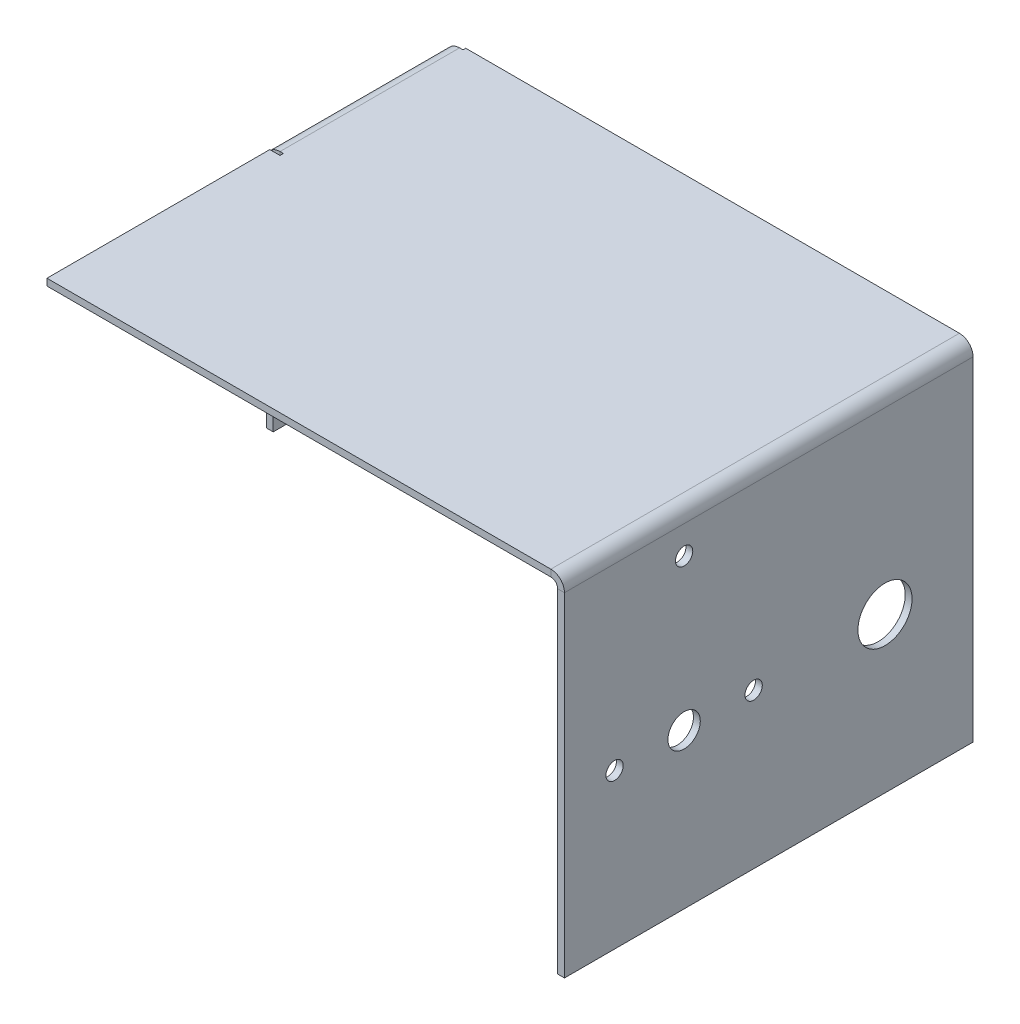
ISO-10303-21;
HEADER;
FILE_DESCRIPTION(('STEP AP214'),'2;1');
FILE_NAME('part.step','',(''),(''),'','','');
FILE_SCHEMA(('AUTOMOTIVE_DESIGN { 1 0 10303 214 1 1 1 1 }'));
ENDSEC;
DATA;
#1=APPLICATION_CONTEXT('core data for automotive mechanical design processes');
#2=APPLICATION_PROTOCOL_DEFINITION('international standard','automotive_design',2000,#1);
#3=PRODUCT_CONTEXT('',#1,'mechanical');
#4=PRODUCT('Part','Part','',(#3));
#5=PRODUCT_RELATED_PRODUCT_CATEGORY('part','',(#4));
#6=PRODUCT_DEFINITION_FORMATION('','',#4);
#7=PRODUCT_DEFINITION_CONTEXT('part definition',#1,'design');
#8=PRODUCT_DEFINITION('design','',#6,#7);
#9=PRODUCT_DEFINITION_SHAPE('','',#8);
#10=(LENGTH_UNIT() NAMED_UNIT(*) SI_UNIT(.MILLI.,.METRE.));
#11=(NAMED_UNIT(*) PLANE_ANGLE_UNIT() SI_UNIT($,.RADIAN.));
#12=(NAMED_UNIT(*) SI_UNIT($,.STERADIAN.) SOLID_ANGLE_UNIT());
#13=UNCERTAINTY_MEASURE_WITH_UNIT(LENGTH_MEASURE(1.E-05),#10,'distance_accuracy_value','');
#14=(GEOMETRIC_REPRESENTATION_CONTEXT(3) GLOBAL_UNCERTAINTY_ASSIGNED_CONTEXT((#13)) GLOBAL_UNIT_ASSIGNED_CONTEXT((#10,
#11,#12)) REPRESENTATION_CONTEXT('',''));
#15=CARTESIAN_POINT('',(0.,0.,0.));
#16=DIRECTION('',(0.,0.,1.));
#17=DIRECTION('',(1.,0.,0.));
#18=AXIS2_PLACEMENT_3D('',#15,#16,#17);
#19=CARTESIAN_POINT('',(0.,-1.,0.));
#20=DIRECTION('',(0.,1.,0.));
#21=DIRECTION('',(0.,0.,1.));
#22=AXIS2_PLACEMENT_3D('',#19,#20,#21);
#23=PLANE('',#22);
#24=DIRECTION('',(0.,0.,1.));
#25=VECTOR('',#24,1.);
#26=CARTESIAN_POINT('',(-36.,-0.99999999999999,-30.094208410316));
#27=LINE('',#26,#25);
#28=CARTESIAN_POINT('',(-36.,-0.99999999999999,-30.));
#29=VERTEX_POINT('',#28);
#30=CARTESIAN_POINT('',(-36.,-0.99999999999999,-29.594208410316));
#31=VERTEX_POINT('',#30);
#32=EDGE_CURVE('E226',#29,#31,#27,.T.);
#33=ORIENTED_EDGE('',*,*,#32,.F.);
#34=DIRECTION('',(-1.,0.,0.));
#35=VECTOR('',#34,1.);
#36=CARTESIAN_POINT('',(37.5,-1.,-30.));
#37=LINE('',#36,#35);
#38=CARTESIAN_POINT('',(36.5,-0.999999999999997,-30.));
#39=VERTEX_POINT('',#38);
#40=EDGE_CURVE('E311',#39,#29,#37,.T.);
#41=ORIENTED_EDGE('',*,*,#40,.F.);
#42=DIRECTION('',(0.,0.,1.));
#43=VECTOR('',#42,1.);
#44=CARTESIAN_POINT('',(36.5,-0.999999999999997,30.));
#45=LINE('',#44,#43);
#46=CARTESIAN_POINT('',(36.5,-0.999999999999997,30.));
#47=VERTEX_POINT('',#46);
#48=EDGE_CURVE('E296',#47,#39,#45,.F.);
#49=ORIENTED_EDGE('',*,*,#48,.F.);
#50=DIRECTION('',(1.,0.,0.));
#51=VECTOR('',#50,1.);
#52=CARTESIAN_POINT('',(37.5,-1.,30.));
#53=LINE('',#52,#51);
#54=CARTESIAN_POINT('',(-37.5,-1.,30.));
#55=VERTEX_POINT('',#54);
#56=EDGE_CURVE('E307',#55,#47,#53,.T.);
#57=ORIENTED_EDGE('',*,*,#56,.F.);
#58=DIRECTION('',(0.,0.,1.));
#59=VECTOR('',#58,1.);
#60=CARTESIAN_POINT('',(-37.5,-1.,30.));
#61=LINE('',#60,#59);
#62=CARTESIAN_POINT('',(-37.5,-0.999999999999995,-2.72486828633828));
#63=VERTEX_POINT('',#62);
#64=EDGE_CURVE('E305',#63,#55,#61,.T.);
#65=ORIENTED_EDGE('',*,*,#64,.F.);
#66=DIRECTION('',(-1.,0.,0.));
#67=VECTOR('',#66,1.);
#68=CARTESIAN_POINT('',(-36.,-0.99999999999999,-2.72486828633828));
#69=LINE('',#68,#67);
#70=CARTESIAN_POINT('',(-36.,-0.99999999999999,-2.72486828633828));
#71=VERTEX_POINT('',#70);
#72=EDGE_CURVE('E239',#71,#63,#69,.T.);
#73=ORIENTED_EDGE('',*,*,#72,.F.);
#74=DIRECTION('',(0.,0.,1.));
#75=VECTOR('',#74,1.);
#76=CARTESIAN_POINT('',(-36.,-0.99999999999999,-3.22486828633828));
#77=LINE('',#76,#75);
#78=CARTESIAN_POINT('',(-36.,-0.99999999999999,-3.22486828633828));
#79=VERTEX_POINT('',#78);
#80=EDGE_CURVE('E235',#79,#71,#77,.T.);
#81=ORIENTED_EDGE('',*,*,#80,.F.);
#82=DIRECTION('',(1.,0.,0.));
#83=VECTOR('',#82,1.);
#84=CARTESIAN_POINT('',(-36.5,-0.99999999999999,-3.22486828633828));
#85=LINE('',#84,#83);
#86=CARTESIAN_POINT('',(-36.5,-0.99999999999999,-3.22486828633828));
#87=VERTEX_POINT('',#86);
#88=EDGE_CURVE('E232',#87,#79,#85,.T.);
#89=ORIENTED_EDGE('',*,*,#88,.F.);
#90=DIRECTION('',(0.,0.,-1.));
#91=VECTOR('',#90,1.);
#92=CARTESIAN_POINT('',(-36.5,-0.99999999999999,-29.594208410316));
#93=LINE('',#92,#91);
#94=CARTESIAN_POINT('',(-36.5,-0.99999999999999,-29.594208410316));
#95=VERTEX_POINT('',#94);
#96=EDGE_CURVE('E216',#95,#87,#93,.F.);
#97=ORIENTED_EDGE('',*,*,#96,.F.);
#98=DIRECTION('',(-1.,0.,0.));
#99=VECTOR('',#98,1.);
#100=CARTESIAN_POINT('',(-36.,-0.99999999999999,-29.594208410316));
#101=LINE('',#100,#99);
#102=EDGE_CURVE('E228',#31,#95,#101,.T.);
#103=ORIENTED_EDGE('',*,*,#102,.F.);
#104=EDGE_LOOP('',(#33,#41,#49,#57,#65,#73,#81,#89,#97,#103));
#105=FACE_BOUND('',#104,.T.);
#106=ADVANCED_FACE('F38',(#105),#23,.F.);
#107=CARTESIAN_POINT('',(0.,0.,0.));
#108=DIRECTION('',(0.,1.,0.));
#109=DIRECTION('',(0.,0.,1.));
#110=AXIS2_PLACEMENT_3D('',#107,#108,#109);
#111=PLANE('',#110);
#112=DIRECTION('',(-1.,0.,0.));
#113=VECTOR('',#112,1.);
#114=CARTESIAN_POINT('',(37.5,0.,-30.));
#115=LINE('',#114,#113);
#116=CARTESIAN_POINT('',(36.5,0.,-30.));
#117=VERTEX_POINT('',#116);
#118=CARTESIAN_POINT('',(-36.,0.,-30.));
#119=VERTEX_POINT('',#118);
#120=EDGE_CURVE('E308',#117,#119,#115,.T.);
#121=ORIENTED_EDGE('',*,*,#120,.T.);
#122=DIRECTION('',(0.,0.,1.));
#123=VECTOR('',#122,1.);
#124=CARTESIAN_POINT('',(-36.,0.,0.));
#125=LINE('',#124,#123);
#126=CARTESIAN_POINT('',(-36.,0.,-29.594208410316));
#127=VERTEX_POINT('',#126);
#128=EDGE_CURVE('E55',#119,#127,#125,.T.);
#129=ORIENTED_EDGE('',*,*,#128,.T.);
#130=DIRECTION('',(-1.,0.,0.));
#131=VECTOR('',#130,1.);
#132=CARTESIAN_POINT('',(0.,0.,-29.594208410316));
#133=LINE('',#132,#131);
#134=CARTESIAN_POINT('',(-36.5,0.,-29.594208410316));
#135=VERTEX_POINT('',#134);
#136=EDGE_CURVE('E11',#127,#135,#133,.T.);
#137=ORIENTED_EDGE('',*,*,#136,.T.);
#138=DIRECTION('',(0.,0.,-1.));
#139=VECTOR('',#138,1.);
#140=CARTESIAN_POINT('',(-36.5,0.,-29.594208410316));
#141=LINE('',#140,#139);
#142=CARTESIAN_POINT('',(-36.5,0.,-3.22486828633828));
#143=VERTEX_POINT('',#142);
#144=EDGE_CURVE('E203',#135,#143,#141,.F.);
#145=ORIENTED_EDGE('',*,*,#144,.T.);
#146=DIRECTION('',(1.,0.,0.));
#147=VECTOR('',#146,1.);
#148=CARTESIAN_POINT('',(0.,0.,-3.22486828633828));
#149=LINE('',#148,#147);
#150=CARTESIAN_POINT('',(-36.,0.,-3.22486828633828));
#151=VERTEX_POINT('',#150);
#152=EDGE_CURVE('E47',#143,#151,#149,.T.);
#153=ORIENTED_EDGE('',*,*,#152,.T.);
#154=DIRECTION('',(0.,0.,1.));
#155=VECTOR('',#154,1.);
#156=CARTESIAN_POINT('',(-36.,0.,0.));
#157=LINE('',#156,#155);
#158=CARTESIAN_POINT('',(-36.,0.,-2.72486828633828));
#159=VERTEX_POINT('',#158);
#160=EDGE_CURVE('E325',#151,#159,#157,.T.);
#161=ORIENTED_EDGE('',*,*,#160,.T.);
#162=DIRECTION('',(-1.,0.,0.));
#163=VECTOR('',#162,1.);
#164=CARTESIAN_POINT('',(0.,0.,-2.72486828633825));
#165=LINE('',#164,#163);
#166=CARTESIAN_POINT('',(-37.5,0.,-2.72486828633828));
#167=VERTEX_POINT('',#166);
#168=EDGE_CURVE('E249',#159,#167,#165,.T.);
#169=ORIENTED_EDGE('',*,*,#168,.T.);
#170=DIRECTION('',(0.,0.,1.));
#171=VECTOR('',#170,1.);
#172=CARTESIAN_POINT('',(-37.5,0.,30.));
#173=LINE('',#172,#171);
#174=CARTESIAN_POINT('',(-37.5,0.,30.));
#175=VERTEX_POINT('',#174);
#176=EDGE_CURVE('E302',#167,#175,#173,.T.);
#177=ORIENTED_EDGE('',*,*,#176,.T.);
#178=DIRECTION('',(1.,0.,0.));
#179=VECTOR('',#178,1.);
#180=CARTESIAN_POINT('',(37.5,0.,30.));
#181=LINE('',#180,#179);
#182=CARTESIAN_POINT('',(36.5,0.,30.));
#183=VERTEX_POINT('',#182);
#184=EDGE_CURVE('E316',#175,#183,#181,.T.);
#185=ORIENTED_EDGE('',*,*,#184,.T.);
#186=DIRECTION('',(0.,0.,1.));
#187=VECTOR('',#186,1.);
#188=CARTESIAN_POINT('',(36.5,0.,30.));
#189=LINE('',#188,#187);
#190=EDGE_CURVE('E285',#183,#117,#189,.F.);
#191=ORIENTED_EDGE('',*,*,#190,.T.);
#192=EDGE_LOOP('',(#121,#129,#137,#145,#153,#161,#169,#177,#185,#191));
#193=FACE_BOUND('',#192,.T.);
#194=ADVANCED_FACE('F386',(#193),#111,.T.);
#195=CARTESIAN_POINT('',(-37.5,-1.,30.));
#196=DIRECTION('',(-1.,0.,0.));
#197=DIRECTION('',(0.,0.,1.));
#198=AXIS2_PLACEMENT_3D('',#195,#196,#197);
#199=PLANE('',#198);
#200=ORIENTED_EDGE('',*,*,#176,.F.);
#201=DIRECTION('',(0.,1.,0.));
#202=VECTOR('',#201,1.);
#203=CARTESIAN_POINT('',(-37.5,-0.999999999999995,-2.72486828633828));
#204=LINE('',#203,#202);
#205=EDGE_CURVE('E241',#63,#167,#204,.T.);
#206=ORIENTED_EDGE('',*,*,#205,.F.);
#207=ORIENTED_EDGE('',*,*,#64,.T.);
#208=DIRECTION('',(0.,1.,0.));
#209=VECTOR('',#208,1.);
#210=CARTESIAN_POINT('',(-37.5,-1.,30.));
#211=LINE('',#210,#209);
#212=EDGE_CURVE('E314',#55,#175,#211,.T.);
#213=ORIENTED_EDGE('',*,*,#212,.T.);
#214=EDGE_LOOP('',(#200,#206,#207,#213));
#215=FACE_BOUND('',#214,.T.);
#216=ADVANCED_FACE('F40',(#215),#199,.T.);
#217=CARTESIAN_POINT('',(37.5,-1.,-30.));
#218=DIRECTION('',(0.,0.,-1.));
#219=DIRECTION('',(-1.,0.,0.));
#220=AXIS2_PLACEMENT_3D('',#217,#218,#219);
#221=PLANE('',#220);
#222=ORIENTED_EDGE('',*,*,#40,.T.);
#223=DIRECTION('',(0.,1.,0.));
#224=VECTOR('',#223,1.);
#225=CARTESIAN_POINT('',(-36.,-1.,-30.));
#226=LINE('',#225,#224);
#227=EDGE_CURVE('E323',#29,#119,#226,.T.);
#228=ORIENTED_EDGE('',*,*,#227,.T.);
#229=ORIENTED_EDGE('',*,*,#120,.F.);
#230=DIRECTION('',(0.,1.,0.));
#231=VECTOR('',#230,1.);
#232=CARTESIAN_POINT('',(36.5,-0.999999999999997,-30.));
#233=LINE('',#232,#231);
#234=EDGE_CURVE('E300',#39,#117,#233,.T.);
#235=ORIENTED_EDGE('',*,*,#234,.F.);
#236=EDGE_LOOP('',(#222,#228,#229,#235));
#237=FACE_BOUND('',#236,.T.);
#238=ADVANCED_FACE('F390',(#237),#221,.T.);
#239=CARTESIAN_POINT('',(37.5,-1.,30.));
#240=DIRECTION('',(0.,0.,1.));
#241=DIRECTION('',(1.,0.,0.));
#242=AXIS2_PLACEMENT_3D('',#239,#240,#241);
#243=PLANE('',#242);
#244=ORIENTED_EDGE('',*,*,#56,.T.);
#245=DIRECTION('',(0.,1.,0.));
#246=VECTOR('',#245,1.);
#247=CARTESIAN_POINT('',(36.5,-0.999999999999997,30.));
#248=LINE('',#247,#246);
#249=EDGE_CURVE('E290',#47,#183,#248,.T.);
#250=ORIENTED_EDGE('',*,*,#249,.T.);
#251=ORIENTED_EDGE('',*,*,#184,.F.);
#252=ORIENTED_EDGE('',*,*,#212,.F.);
#253=EDGE_LOOP('',(#244,#250,#251,#252));
#254=FACE_BOUND('',#253,.T.);
#255=ADVANCED_FACE('F416',(#254),#243,.T.);
#256=CARTESIAN_POINT('',(36.5,-2.,-30.));
#257=DIRECTION('',(0.,0.,-1.));
#258=DIRECTION('',(-1.,0.,0.));
#259=AXIS2_PLACEMENT_3D('',#256,#257,#258);
#260=PLANE('',#259);
#261=DIRECTION('',(1.,0.,0.));
#262=VECTOR('',#261,1.);
#263=CARTESIAN_POINT('',(37.5,-1.99999999999999,-30.));
#264=LINE('',#263,#262);
#265=CARTESIAN_POINT('',(37.5,-1.99999999999999,-30.));
#266=VERTEX_POINT('',#265);
#267=CARTESIAN_POINT('',(38.5,-1.99999999999999,-30.));
#268=VERTEX_POINT('',#267);
#269=EDGE_CURVE('E252',#266,#268,#264,.T.);
#270=ORIENTED_EDGE('',*,*,#269,.F.);
#271=CARTESIAN_POINT('',(36.5,-2.,-30.));
#272=DIRECTION('',(0.,0.,1.));
#273=DIRECTION('',(1.,0.,0.));
#274=AXIS2_PLACEMENT_3D('',#271,#272,#273);
#275=CIRCLE('',#274,1.);
#276=EDGE_CURVE('E293',#39,#266,#275,.F.);
#277=ORIENTED_EDGE('',*,*,#276,.F.);
#278=ORIENTED_EDGE('',*,*,#234,.T.);
#279=CARTESIAN_POINT('',(36.5,-2.,-30.));
#280=DIRECTION('',(0.,0.,1.));
#281=DIRECTION('',(1.,0.,0.));
#282=AXIS2_PLACEMENT_3D('',#279,#280,#281);
#283=CIRCLE('',#282,2.);
#284=EDGE_CURVE('E63',#117,#268,#283,.F.);
#285=ORIENTED_EDGE('',*,*,#284,.T.);
#286=EDGE_LOOP('',(#270,#277,#278,#285));
#287=FACE_BOUND('',#286,.T.);
#288=ADVANCED_FACE('F445',(#287),#260,.T.);
#289=CARTESIAN_POINT('',(36.5,-2.,30.));
#290=DIRECTION('',(0.,0.,-1.));
#291=DIRECTION('',(-1.,0.,0.));
#292=AXIS2_PLACEMENT_3D('',#289,#290,#291);
#293=PLANE('',#292);
#294=CARTESIAN_POINT('',(36.5,-2.,30.));
#295=DIRECTION('',(0.,0.,1.));
#296=DIRECTION('',(1.,0.,0.));
#297=AXIS2_PLACEMENT_3D('',#294,#295,#296);
#298=CIRCLE('',#297,1.);
#299=CARTESIAN_POINT('',(37.5,-1.99999999999999,30.));
#300=VERTEX_POINT('',#299);
#301=EDGE_CURVE('E282',#300,#47,#298,.T.);
#302=ORIENTED_EDGE('',*,*,#301,.F.);
#303=DIRECTION('',(1.,0.,0.));
#304=VECTOR('',#303,1.);
#305=CARTESIAN_POINT('',(37.5,-1.99999999999999,30.));
#306=LINE('',#305,#304);
#307=CARTESIAN_POINT('',(38.5,-1.99999999999999,30.));
#308=VERTEX_POINT('',#307);
#309=EDGE_CURVE('E255',#300,#308,#306,.T.);
#310=ORIENTED_EDGE('',*,*,#309,.T.);
#311=CARTESIAN_POINT('',(36.5,-2.,30.));
#312=DIRECTION('',(0.,0.,1.));
#313=DIRECTION('',(1.,0.,0.));
#314=AXIS2_PLACEMENT_3D('',#311,#312,#313);
#315=CIRCLE('',#314,2.);
#316=EDGE_CURVE('E288',#308,#183,#315,.T.);
#317=ORIENTED_EDGE('',*,*,#316,.T.);
#318=ORIENTED_EDGE('',*,*,#249,.F.);
#319=EDGE_LOOP('',(#302,#310,#317,#318));
#320=FACE_BOUND('',#319,.T.);
#321=ADVANCED_FACE('F420',(#320),#293,.F.);
#322=CARTESIAN_POINT('',(36.5,-2.,30.));
#323=DIRECTION('',(0.,0.,1.));
#324=DIRECTION('',(1.,0.,0.));
#325=AXIS2_PLACEMENT_3D('',#322,#323,#324);
#326=CYLINDRICAL_SURFACE('',#325,2.);
#327=ORIENTED_EDGE('',*,*,#190,.F.);
#328=ORIENTED_EDGE('',*,*,#316,.F.);
#329=DIRECTION('',(0.,0.,1.));
#330=VECTOR('',#329,1.);
#331=CARTESIAN_POINT('',(38.5,-1.99999999999999,0.));
#332=LINE('',#331,#330);
#333=EDGE_CURVE('E258',#268,#308,#332,.T.);
#334=ORIENTED_EDGE('',*,*,#333,.F.);
#335=ORIENTED_EDGE('',*,*,#284,.F.);
#336=EDGE_LOOP('',(#327,#328,#334,#335));
#337=FACE_BOUND('',#336,.T.);
#338=ADVANCED_FACE('F443',(#337),#326,.T.);
#339=CARTESIAN_POINT('',(36.5,-2.,30.));
#340=DIRECTION('',(0.,0.,1.));
#341=DIRECTION('',(1.,0.,0.));
#342=AXIS2_PLACEMENT_3D('',#339,#340,#341);
#343=CYLINDRICAL_SURFACE('',#342,1.);
#344=ORIENTED_EDGE('',*,*,#48,.T.);
#345=ORIENTED_EDGE('',*,*,#276,.T.);
#346=DIRECTION('',(0.,0.,1.));
#347=VECTOR('',#346,1.);
#348=CARTESIAN_POINT('',(37.5,-1.99999999999999,-30.));
#349=LINE('',#348,#347);
#350=EDGE_CURVE('E253',#266,#300,#349,.T.);
#351=ORIENTED_EDGE('',*,*,#350,.T.);
#352=ORIENTED_EDGE('',*,*,#301,.T.);
#353=EDGE_LOOP('',(#344,#345,#351,#352));
#354=FACE_BOUND('',#353,.T.);
#355=ADVANCED_FACE('F422',(#354),#343,.F.);
#356=CARTESIAN_POINT('',(38.5,-0.999999999999997,30.));
#357=DIRECTION('',(0.,0.,1.));
#358=DIRECTION('',(0.,-1.,0.));
#359=AXIS2_PLACEMENT_3D('',#356,#357,#358);
#360=PLANE('',#359);
#361=DIRECTION('',(0.,1.,0.));
#362=VECTOR('',#361,1.);
#363=CARTESIAN_POINT('',(38.5,-0.999999999999997,30.));
#364=LINE('',#363,#362);
#365=CARTESIAN_POINT('',(38.5000000000002,-51.,30.));
#366=VERTEX_POINT('',#365);
#367=EDGE_CURVE('E270',#366,#308,#364,.T.);
#368=ORIENTED_EDGE('',*,*,#367,.T.);
#369=ORIENTED_EDGE('',*,*,#309,.F.);
#370=DIRECTION('',(0.,1.,0.));
#371=VECTOR('',#370,1.);
#372=CARTESIAN_POINT('',(37.5,-1.,30.));
#373=LINE('',#372,#371);
#374=CARTESIAN_POINT('',(37.5000000000002,-51.,30.));
#375=VERTEX_POINT('',#374);
#376=EDGE_CURVE('E267',#375,#300,#373,.T.);
#377=ORIENTED_EDGE('',*,*,#376,.F.);
#378=DIRECTION('',(-1.,0.,0.));
#379=VECTOR('',#378,1.);
#380=CARTESIAN_POINT('',(38.5000000000002,-51.,30.));
#381=LINE('',#380,#379);
#382=EDGE_CURVE('E280',#366,#375,#381,.T.);
#383=ORIENTED_EDGE('',*,*,#382,.F.);
#384=EDGE_LOOP('',(#368,#369,#377,#383));
#385=FACE_BOUND('',#384,.T.);
#386=ADVANCED_FACE('F439',(#385),#360,.T.);
#387=CARTESIAN_POINT('',(38.5000000000002,-51.,-30.));
#388=DIRECTION('',(0.,0.,-1.));
#389=DIRECTION('',(0.,1.,0.));
#390=AXIS2_PLACEMENT_3D('',#387,#388,#389);
#391=PLANE('',#390);
#392=DIRECTION('',(0.,-1.,0.));
#393=VECTOR('',#392,1.);
#394=CARTESIAN_POINT('',(37.5000000000002,-51.,-30.));
#395=LINE('',#394,#393);
#396=CARTESIAN_POINT('',(37.5000000000002,-51.,-30.));
#397=VERTEX_POINT('',#396);
#398=EDGE_CURVE('E263',#266,#397,#395,.T.);
#399=ORIENTED_EDGE('',*,*,#398,.F.);
#400=ORIENTED_EDGE('',*,*,#269,.T.);
#401=DIRECTION('',(0.,-1.,0.));
#402=VECTOR('',#401,1.);
#403=CARTESIAN_POINT('',(38.5000000000002,-51.,-30.));
#404=LINE('',#403,#402);
#405=CARTESIAN_POINT('',(38.5000000000002,-51.,-30.));
#406=VERTEX_POINT('',#405);
#407=EDGE_CURVE('E264',#268,#406,#404,.T.);
#408=ORIENTED_EDGE('',*,*,#407,.T.);
#409=DIRECTION('',(-1.,0.,0.));
#410=VECTOR('',#409,1.);
#411=CARTESIAN_POINT('',(38.5000000000002,-51.,-30.));
#412=LINE('',#411,#410);
#413=EDGE_CURVE('E273',#406,#397,#412,.T.);
#414=ORIENTED_EDGE('',*,*,#413,.T.);
#415=EDGE_LOOP('',(#399,#400,#408,#414));
#416=FACE_BOUND('',#415,.T.);
#417=ADVANCED_FACE('F431',(#416),#391,.T.);
#418=CARTESIAN_POINT('',(38.5,1.33595742037104E-13,0.));
#419=DIRECTION('',(1.,0.,0.));
#420=DIRECTION('',(0.,1.,0.));
#421=AXIS2_PLACEMENT_3D('',#418,#419,#420);
#422=PLANE('',#421);
#423=CARTESIAN_POINT('',(38.5000000000001,-28.2877300000001,-17.0691799999999));
#424=DIRECTION('',(1.,0.,0.));
#425=DIRECTION('',(0.,1.,0.));
#426=AXIS2_PLACEMENT_3D('',#423,#424,#425);
#427=CIRCLE('',#426,3.975);
#428=CARTESIAN_POINT('',(38.5000000000001,-24.3127300000001,-17.0691799999999));
#429=VERTEX_POINT('',#428);
#430=EDGE_CURVE('E802',#429,#429,#427,.T.);
#431=ORIENTED_EDGE('',*,*,#430,.F.);
#432=EDGE_LOOP('',(#431));
#433=FACE_BOUND('',#432,.T.);
#434=CARTESIAN_POINT('',(38.5,-6.11353000000009,12.4308200000001));
#435=DIRECTION('',(1.,0.,0.));
#436=DIRECTION('',(0.,1.,0.));
#437=AXIS2_PLACEMENT_3D('',#434,#435,#436);
#438=CIRCLE('',#437,1.27);
#439=CARTESIAN_POINT('',(38.5,-4.84353000000009,12.4308200000001));
#440=VERTEX_POINT('',#439);
#441=EDGE_CURVE('E343',#440,#440,#438,.T.);
#442=ORIENTED_EDGE('',*,*,#441,.F.);
#443=EDGE_LOOP('',(#442));
#444=FACE_BOUND('',#443,.T.);
#445=CARTESIAN_POINT('',(38.5000000000001,-28.2877300000001,2.22002000000015));
#446=DIRECTION('',(1.,0.,0.));
#447=DIRECTION('',(0.,1.,0.));
#448=AXIS2_PLACEMENT_3D('',#445,#446,#447);
#449=CIRCLE('',#448,1.27);
#450=CARTESIAN_POINT('',(38.5000000000001,-27.0177300000001,2.22002000000015));
#451=VERTEX_POINT('',#450);
#452=EDGE_CURVE('E340',#451,#451,#449,.T.);
#453=ORIENTED_EDGE('',*,*,#452,.F.);
#454=EDGE_LOOP('',(#453));
#455=FACE_BOUND('',#454,.T.);
#456=CARTESIAN_POINT('',(38.5000000000001,-28.2877300000001,12.4308200000001));
#457=DIRECTION('',(1.,0.,0.));
#458=DIRECTION('',(0.,1.,0.));
#459=AXIS2_PLACEMENT_3D('',#456,#457,#458);
#460=CIRCLE('',#459,2.3749);
#461=CARTESIAN_POINT('',(38.5000000000001,-25.9128300000001,12.4308200000001));
#462=VERTEX_POINT('',#461);
#463=EDGE_CURVE('E337',#462,#462,#460,.T.);
#464=ORIENTED_EDGE('',*,*,#463,.F.);
#465=EDGE_LOOP('',(#464));
#466=FACE_BOUND('',#465,.T.);
#467=CARTESIAN_POINT('',(38.5000000000001,-28.2877300000001,22.6416200000001));
#468=DIRECTION('',(1.,0.,0.));
#469=DIRECTION('',(0.,1.,0.));
#470=AXIS2_PLACEMENT_3D('',#467,#468,#469);
#471=CIRCLE('',#470,1.27);
#472=CARTESIAN_POINT('',(38.5000000000001,-27.0177300000001,22.6416200000001));
#473=VERTEX_POINT('',#472);
#474=EDGE_CURVE('E333',#473,#473,#471,.T.);
#475=ORIENTED_EDGE('',*,*,#474,.F.);
#476=EDGE_LOOP('',(#475));
#477=FACE_BOUND('',#476,.T.);
#478=ORIENTED_EDGE('',*,*,#407,.F.);
#479=ORIENTED_EDGE('',*,*,#333,.T.);
#480=ORIENTED_EDGE('',*,*,#367,.F.);
#481=DIRECTION('',(0.,0.,1.));
#482=VECTOR('',#481,1.);
#483=CARTESIAN_POINT('',(38.5000000000002,-51.,30.));
#484=LINE('',#483,#482);
#485=EDGE_CURVE('E266',#406,#366,#484,.T.);
#486=ORIENTED_EDGE('',*,*,#485,.F.);
#487=EDGE_LOOP('',(#478,#479,#480,#486));
#488=FACE_BOUND('',#487,.T.);
#489=ADVANCED_FACE('F442',(#433,#444,#455,#466,#477,#488),#422,.T.);
#490=CARTESIAN_POINT('',(37.5,1.3010426069826E-13,0.));
#491=DIRECTION('',(1.,0.,0.));
#492=DIRECTION('',(0.,1.,0.));
#493=AXIS2_PLACEMENT_3D('',#490,#491,#492);
#494=PLANE('',#493);
#495=CARTESIAN_POINT('',(37.5000000000001,-28.2877300000001,-17.0691799999999));
#496=DIRECTION('',(1.,0.,0.));
#497=DIRECTION('',(0.,1.,0.));
#498=AXIS2_PLACEMENT_3D('',#495,#496,#497);
#499=CIRCLE('',#498,3.975);
#500=CARTESIAN_POINT('',(37.5000000000001,-24.3127300000001,-17.0691799999999));
#501=VERTEX_POINT('',#500);
#502=EDGE_CURVE('E349',#501,#501,#499,.T.);
#503=ORIENTED_EDGE('',*,*,#502,.T.);
#504=EDGE_LOOP('',(#503));
#505=FACE_BOUND('',#504,.T.);
#506=CARTESIAN_POINT('',(37.5,-6.1135300000001,12.4308200000001));
#507=DIRECTION('',(1.,0.,0.));
#508=DIRECTION('',(0.,1.,0.));
#509=AXIS2_PLACEMENT_3D('',#506,#507,#508);
#510=CIRCLE('',#509,1.27);
#511=CARTESIAN_POINT('',(37.5,-4.8435300000001,12.4308200000001));
#512=VERTEX_POINT('',#511);
#513=EDGE_CURVE('E341',#512,#512,#510,.T.);
#514=ORIENTED_EDGE('',*,*,#513,.T.);
#515=EDGE_LOOP('',(#514));
#516=FACE_BOUND('',#515,.T.);
#517=CARTESIAN_POINT('',(37.5000000000001,-28.2877300000001,2.22002000000015));
#518=DIRECTION('',(1.,0.,0.));
#519=DIRECTION('',(0.,1.,0.));
#520=AXIS2_PLACEMENT_3D('',#517,#518,#519);
#521=CIRCLE('',#520,1.27);
#522=CARTESIAN_POINT('',(37.5000000000001,-27.0177300000001,2.22002000000015));
#523=VERTEX_POINT('',#522);
#524=EDGE_CURVE('E338',#523,#523,#521,.T.);
#525=ORIENTED_EDGE('',*,*,#524,.T.);
#526=EDGE_LOOP('',(#525));
#527=FACE_BOUND('',#526,.T.);
#528=CARTESIAN_POINT('',(37.5000000000001,-28.2877300000001,12.4308200000001));
#529=DIRECTION('',(1.,0.,0.));
#530=DIRECTION('',(0.,1.,0.));
#531=AXIS2_PLACEMENT_3D('',#528,#529,#530);
#532=CIRCLE('',#531,2.3749);
#533=CARTESIAN_POINT('',(37.5000000000001,-25.9128300000001,12.4308200000001));
#534=VERTEX_POINT('',#533);
#535=EDGE_CURVE('E334',#534,#534,#532,.T.);
#536=ORIENTED_EDGE('',*,*,#535,.T.);
#537=EDGE_LOOP('',(#536));
#538=FACE_BOUND('',#537,.T.);
#539=CARTESIAN_POINT('',(37.5000000000001,-28.2877300000001,22.6416200000001));
#540=DIRECTION('',(1.,0.,0.));
#541=DIRECTION('',(0.,1.,0.));
#542=AXIS2_PLACEMENT_3D('',#539,#540,#541);
#543=CIRCLE('',#542,1.27);
#544=CARTESIAN_POINT('',(37.5000000000001,-27.0177300000001,22.6416200000001));
#545=VERTEX_POINT('',#544);
#546=EDGE_CURVE('E330',#545,#545,#543,.T.);
#547=ORIENTED_EDGE('',*,*,#546,.T.);
#548=EDGE_LOOP('',(#547));
#549=FACE_BOUND('',#548,.T.);
#550=ORIENTED_EDGE('',*,*,#350,.F.);
#551=ORIENTED_EDGE('',*,*,#398,.T.);
#552=DIRECTION('',(0.,0.,1.));
#553=VECTOR('',#552,1.);
#554=CARTESIAN_POINT('',(37.5000000000002,-51.,30.));
#555=LINE('',#554,#553);
#556=EDGE_CURVE('E275',#397,#375,#555,.T.);
#557=ORIENTED_EDGE('',*,*,#556,.T.);
#558=ORIENTED_EDGE('',*,*,#376,.T.);
#559=EDGE_LOOP('',(#550,#551,#557,#558));
#560=FACE_BOUND('',#559,.T.);
#561=ADVANCED_FACE('F427',(#505,#516,#527,#538,#549,#560),#494,.F.);
#562=CARTESIAN_POINT('',(38.5000000000002,-51.,30.));
#563=DIRECTION('',(0.,-1.,0.));
#564=DIRECTION('',(1.,0.,0.));
#565=AXIS2_PLACEMENT_3D('',#562,#563,#564);
#566=PLANE('',#565);
#567=ORIENTED_EDGE('',*,*,#556,.F.);
#568=ORIENTED_EDGE('',*,*,#413,.F.);
#569=ORIENTED_EDGE('',*,*,#485,.T.);
#570=ORIENTED_EDGE('',*,*,#382,.T.);
#571=EDGE_LOOP('',(#567,#568,#569,#570));
#572=FACE_BOUND('',#571,.T.);
#573=ADVANCED_FACE('F437',(#572),#566,.T.);
#574=CARTESIAN_POINT('',(-36.,-0.99999999999999,-30.094208410316));
#575=DIRECTION('',(-1.,0.,0.));
#576=DIRECTION('',(0.,0.,1.));
#577=AXIS2_PLACEMENT_3D('',#574,#575,#576);
#578=PLANE('',#577);
#579=ORIENTED_EDGE('',*,*,#128,.F.);
#580=ORIENTED_EDGE('',*,*,#227,.F.);
#581=ORIENTED_EDGE('',*,*,#32,.T.);
#582=DIRECTION('',(0.,1.,0.));
#583=VECTOR('',#582,1.);
#584=CARTESIAN_POINT('',(-36.,-0.99999999999999,-29.594208410316));
#585=LINE('',#584,#583);
#586=EDGE_CURVE('E231',#31,#127,#585,.T.);
#587=ORIENTED_EDGE('',*,*,#586,.T.);
#588=EDGE_LOOP('',(#579,#580,#581,#587));
#589=FACE_BOUND('',#588,.T.);
#590=ADVANCED_FACE('F393',(#589),#578,.T.);
#591=CARTESIAN_POINT('',(-36.,-0.99999999999999,-29.594208410316));
#592=DIRECTION('',(0.,0.,-1.));
#593=DIRECTION('',(0.,1.,0.));
#594=AXIS2_PLACEMENT_3D('',#591,#592,#593);
#595=PLANE('',#594);
#596=ORIENTED_EDGE('',*,*,#136,.F.);
#597=ORIENTED_EDGE('',*,*,#586,.F.);
#598=ORIENTED_EDGE('',*,*,#102,.T.);
#599=DIRECTION('',(0.,1.,0.));
#600=VECTOR('',#599,1.);
#601=CARTESIAN_POINT('',(-36.5,-0.99999999999999,-29.594208410316));
#602=LINE('',#601,#600);
#603=EDGE_CURVE('E210',#95,#135,#602,.T.);
#604=ORIENTED_EDGE('',*,*,#603,.T.);
#605=EDGE_LOOP('',(#596,#597,#598,#604));
#606=FACE_BOUND('',#605,.T.);
#607=ADVANCED_FACE('F381',(#606),#595,.T.);
#608=CARTESIAN_POINT('',(-36.5,-0.99999999999999,-3.22486828633828));
#609=DIRECTION('',(0.,0.,1.));
#610=DIRECTION('',(0.,-1.,0.));
#611=AXIS2_PLACEMENT_3D('',#608,#609,#610);
#612=PLANE('',#611);
#613=ORIENTED_EDGE('',*,*,#152,.F.);
#614=DIRECTION('',(0.,1.,0.));
#615=VECTOR('',#614,1.);
#616=CARTESIAN_POINT('',(-36.5,-0.99999999999999,-3.22486828633828));
#617=LINE('',#616,#615);
#618=EDGE_CURVE('E220',#87,#143,#617,.T.);
#619=ORIENTED_EDGE('',*,*,#618,.F.);
#620=ORIENTED_EDGE('',*,*,#88,.T.);
#621=DIRECTION('',(0.,1.,0.));
#622=VECTOR('',#621,1.);
#623=CARTESIAN_POINT('',(-36.,-0.99999999999999,-3.22486828633828));
#624=LINE('',#623,#622);
#625=EDGE_CURVE('E238',#79,#151,#624,.T.);
#626=ORIENTED_EDGE('',*,*,#625,.T.);
#627=EDGE_LOOP('',(#613,#619,#620,#626));
#628=FACE_BOUND('',#627,.T.);
#629=ADVANCED_FACE('F403',(#628),#612,.T.);
#630=CARTESIAN_POINT('',(-36.,-0.99999999999999,-3.22486828633828));
#631=DIRECTION('',(-1.,0.,0.));
#632=DIRECTION('',(0.,0.,1.));
#633=AXIS2_PLACEMENT_3D('',#630,#631,#632);
#634=PLANE('',#633);
#635=ORIENTED_EDGE('',*,*,#160,.F.);
#636=ORIENTED_EDGE('',*,*,#625,.F.);
#637=ORIENTED_EDGE('',*,*,#80,.T.);
#638=DIRECTION('',(0.,1.,0.));
#639=VECTOR('',#638,1.);
#640=CARTESIAN_POINT('',(-36.,-0.99999999999999,-2.72486828633828));
#641=LINE('',#640,#639);
#642=EDGE_CURVE('E223',#71,#159,#641,.T.);
#643=ORIENTED_EDGE('',*,*,#642,.T.);
#644=EDGE_LOOP('',(#635,#636,#637,#643));
#645=FACE_BOUND('',#644,.T.);
#646=ADVANCED_FACE('F406',(#645),#634,.T.);
#647=CARTESIAN_POINT('',(-36.,-0.99999999999999,-2.72486828633828));
#648=DIRECTION('',(0.,0.,-1.));
#649=DIRECTION('',(-1.,0.,0.));
#650=AXIS2_PLACEMENT_3D('',#647,#648,#649);
#651=PLANE('',#650);
#652=ORIENTED_EDGE('',*,*,#168,.F.);
#653=ORIENTED_EDGE('',*,*,#642,.F.);
#654=ORIENTED_EDGE('',*,*,#72,.T.);
#655=ORIENTED_EDGE('',*,*,#205,.T.);
#656=EDGE_LOOP('',(#652,#653,#654,#655));
#657=FACE_BOUND('',#656,.T.);
#658=ADVANCED_FACE('F409',(#657),#651,.T.);
#659=CARTESIAN_POINT('',(-36.5,-2.,-3.22486828633828));
#660=DIRECTION('',(0.,0.,1.));
#661=DIRECTION('',(1.,0.,0.));
#662=AXIS2_PLACEMENT_3D('',#659,#660,#661);
#663=PLANE('',#662);
#664=DIRECTION('',(-1.,0.,0.));
#665=VECTOR('',#664,1.);
#666=CARTESIAN_POINT('',(-37.5,-1.99999999999999,-3.22486828633828));
#667=LINE('',#666,#665);
#668=CARTESIAN_POINT('',(-37.5,-1.99999999999999,-3.22486828633828));
#669=VERTEX_POINT('',#668);
#670=CARTESIAN_POINT('',(-38.5,-1.99999999999999,-3.22486828633828));
#671=VERTEX_POINT('',#670);
#672=EDGE_CURVE('E173',#669,#671,#667,.T.);
#673=ORIENTED_EDGE('',*,*,#672,.F.);
#674=CARTESIAN_POINT('',(-36.5,-2.,-3.22486828633828));
#675=DIRECTION('',(0.,0.,-1.));
#676=DIRECTION('',(-1.,0.,0.));
#677=AXIS2_PLACEMENT_3D('',#674,#675,#676);
#678=CIRCLE('',#677,1.00000000000001);
#679=EDGE_CURVE('E213',#87,#669,#678,.F.);
#680=ORIENTED_EDGE('',*,*,#679,.F.);
#681=ORIENTED_EDGE('',*,*,#618,.T.);
#682=CARTESIAN_POINT('',(-36.5,-2.,-3.22486828633828));
#683=DIRECTION('',(0.,0.,-1.));
#684=DIRECTION('',(-1.,0.,0.));
#685=AXIS2_PLACEMENT_3D('',#682,#683,#684);
#686=CIRCLE('',#685,2.00000000000001);
#687=EDGE_CURVE('E206',#143,#671,#686,.F.);
#688=ORIENTED_EDGE('',*,*,#687,.T.);
#689=EDGE_LOOP('',(#673,#680,#681,#688));
#690=FACE_BOUND('',#689,.T.);
#691=ADVANCED_FACE('F400',(#690),#663,.T.);
#692=CARTESIAN_POINT('',(-36.5,-2.,-29.594208410316));
#693=DIRECTION('',(0.,0.,1.));
#694=DIRECTION('',(1.,0.,0.));
#695=AXIS2_PLACEMENT_3D('',#692,#693,#694);
#696=PLANE('',#695);
#697=CARTESIAN_POINT('',(-36.5,-2.,-29.594208410316));
#698=DIRECTION('',(0.,0.,-1.));
#699=DIRECTION('',(-1.,0.,0.));
#700=AXIS2_PLACEMENT_3D('',#697,#698,#699);
#701=CIRCLE('',#700,1.00000000000001);
#702=CARTESIAN_POINT('',(-37.5,-1.99999999999999,-29.594208410316));
#703=VERTEX_POINT('',#702);
#704=EDGE_CURVE('E201',#703,#95,#701,.T.);
#705=ORIENTED_EDGE('',*,*,#704,.F.);
#706=DIRECTION('',(-1.,0.,0.));
#707=VECTOR('',#706,1.);
#708=CARTESIAN_POINT('',(-37.5,-1.99999999999999,-29.594208410316));
#709=LINE('',#708,#707);
#710=CARTESIAN_POINT('',(-38.5,-1.99999999999999,-29.594208410316));
#711=VERTEX_POINT('',#710);
#712=EDGE_CURVE('E363',#703,#711,#709,.T.);
#713=ORIENTED_EDGE('',*,*,#712,.T.);
#714=CARTESIAN_POINT('',(-36.5,-2.,-29.594208410316));
#715=DIRECTION('',(0.,0.,-1.));
#716=DIRECTION('',(-1.,0.,0.));
#717=AXIS2_PLACEMENT_3D('',#714,#715,#716);
#718=CIRCLE('',#717,2.00000000000001);
#719=EDGE_CURVE('E207',#711,#135,#718,.T.);
#720=ORIENTED_EDGE('',*,*,#719,.T.);
#721=ORIENTED_EDGE('',*,*,#603,.F.);
#722=EDGE_LOOP('',(#705,#713,#720,#721));
#723=FACE_BOUND('',#722,.T.);
#724=ADVANCED_FACE('F379',(#723),#696,.F.);
#725=CARTESIAN_POINT('',(-36.5,-2.,-29.594208410316));
#726=DIRECTION('',(0.,0.,-1.));
#727=DIRECTION('',(-1.,0.,0.));
#728=AXIS2_PLACEMENT_3D('',#725,#726,#727);
#729=CYLINDRICAL_SURFACE('',#728,2.00000000000001);
#730=ORIENTED_EDGE('',*,*,#144,.F.);
#731=ORIENTED_EDGE('',*,*,#719,.F.);
#732=DIRECTION('',(0.,0.,-1.));
#733=VECTOR('',#732,1.);
#734=CARTESIAN_POINT('',(-38.5,-1.99999999999999,0.));
#735=LINE('',#734,#733);
#736=EDGE_CURVE('E197',#671,#711,#735,.T.);
#737=ORIENTED_EDGE('',*,*,#736,.F.);
#738=ORIENTED_EDGE('',*,*,#687,.F.);
#739=EDGE_LOOP('',(#730,#731,#737,#738));
#740=FACE_BOUND('',#739,.T.);
#741=ADVANCED_FACE('F635',(#740),#729,.T.);
#742=CARTESIAN_POINT('',(-36.5,-2.,-29.594208410316));
#743=DIRECTION('',(0.,0.,-1.));
#744=DIRECTION('',(-1.,0.,0.));
#745=AXIS2_PLACEMENT_3D('',#742,#743,#744);
#746=CYLINDRICAL_SURFACE('',#745,1.00000000000001);
#747=ORIENTED_EDGE('',*,*,#96,.T.);
#748=ORIENTED_EDGE('',*,*,#679,.T.);
#749=DIRECTION('',(0.,0.,-1.));
#750=VECTOR('',#749,1.);
#751=CARTESIAN_POINT('',(-37.5,-1.99999999999999,-3.22486828633828));
#752=LINE('',#751,#750);
#753=EDGE_CURVE('E361',#669,#703,#752,.T.);
#754=ORIENTED_EDGE('',*,*,#753,.T.);
#755=ORIENTED_EDGE('',*,*,#704,.T.);
#756=EDGE_LOOP('',(#747,#748,#754,#755));
#757=FACE_BOUND('',#756,.T.);
#758=ADVANCED_FACE('F376',(#757),#746,.F.);
#759=CARTESIAN_POINT('',(-38.5,-0.999999999999997,-29.594208410316));
#760=DIRECTION('',(0.,0.,-1.));
#761=DIRECTION('',(-1.,0.,0.));
#762=AXIS2_PLACEMENT_3D('',#759,#760,#761);
#763=PLANE('',#762);
#764=DIRECTION('',(0.,1.,0.));
#765=VECTOR('',#764,1.);
#766=CARTESIAN_POINT('',(-38.5,-0.999999999999997,-29.594208410316));
#767=LINE('',#766,#765);
#768=CARTESIAN_POINT('',(-38.5000000000001,-36.15913260037,-29.594208410316));
#769=VERTEX_POINT('',#768);
#770=EDGE_CURVE('E187',#769,#711,#767,.T.);
#771=ORIENTED_EDGE('',*,*,#770,.T.);
#772=ORIENTED_EDGE('',*,*,#712,.F.);
#773=DIRECTION('',(0.,1.,0.));
#774=VECTOR('',#773,1.);
#775=CARTESIAN_POINT('',(-37.5,-1.,-29.594208410316));
#776=LINE('',#775,#774);
#777=CARTESIAN_POINT('',(-37.5000000000001,-36.15913260037,-29.594208410316));
#778=VERTEX_POINT('',#777);
#779=EDGE_CURVE('E178',#778,#703,#776,.T.);
#780=ORIENTED_EDGE('',*,*,#779,.F.);
#781=DIRECTION('',(1.,0.,0.));
#782=VECTOR('',#781,1.);
#783=CARTESIAN_POINT('',(-38.5000000000001,-36.15913260037,-29.594208410316));
#784=LINE('',#783,#782);
#785=EDGE_CURVE('E186',#769,#778,#784,.T.);
#786=ORIENTED_EDGE('',*,*,#785,.F.);
#787=EDGE_LOOP('',(#771,#772,#780,#786));
#788=FACE_BOUND('',#787,.T.);
#789=ADVANCED_FACE('F369',(#788),#763,.T.);
#790=CARTESIAN_POINT('',(-38.5000000000001,-36.15913260037,-3.22486828633828));
#791=DIRECTION('',(0.,0.,1.));
#792=DIRECTION('',(0.,-1.,0.));
#793=AXIS2_PLACEMENT_3D('',#790,#791,#792);
#794=PLANE('',#793);
#795=DIRECTION('',(0.,-1.,0.));
#796=VECTOR('',#795,1.);
#797=CARTESIAN_POINT('',(-37.5000000000001,-36.15913260037,-3.22486828633828));
#798=LINE('',#797,#796);
#799=CARTESIAN_POINT('',(-37.5000000000001,-36.15913260037,-3.22486828633828));
#800=VERTEX_POINT('',#799);
#801=EDGE_CURVE('E195',#669,#800,#798,.T.);
#802=ORIENTED_EDGE('',*,*,#801,.F.);
#803=ORIENTED_EDGE('',*,*,#672,.T.);
#804=DIRECTION('',(0.,-1.,0.));
#805=VECTOR('',#804,1.);
#806=CARTESIAN_POINT('',(-38.5000000000001,-36.15913260037,-3.22486828633828));
#807=LINE('',#806,#805);
#808=CARTESIAN_POINT('',(-38.5000000000001,-36.15913260037,-3.22486828633828));
#809=VERTEX_POINT('',#808);
#810=EDGE_CURVE('E167',#671,#809,#807,.T.);
#811=ORIENTED_EDGE('',*,*,#810,.T.);
#812=DIRECTION('',(1.,0.,0.));
#813=VECTOR('',#812,1.);
#814=CARTESIAN_POINT('',(-38.5000000000001,-36.15913260037,-3.22486828633828));
#815=LINE('',#814,#813);
#816=EDGE_CURVE('E171',#809,#800,#815,.T.);
#817=ORIENTED_EDGE('',*,*,#816,.T.);
#818=EDGE_LOOP('',(#802,#803,#811,#817));
#819=FACE_BOUND('',#818,.T.);
#820=ADVANCED_FACE('F170',(#819),#794,.T.);
#821=CARTESIAN_POINT('',(-38.5,1.36707321398791E-13,0.));
#822=DIRECTION('',(-1.,0.,0.));
#823=DIRECTION('',(0.,-1.,0.));
#824=AXIS2_PLACEMENT_3D('',#821,#822,#823);
#825=PLANE('',#824);
#826=CARTESIAN_POINT('',(-38.5000000000002,-28.2877300000004,-17.0691799999999));
#827=DIRECTION('',(1.,0.,0.));
#828=DIRECTION('',(0.,1.,0.));
#829=AXIS2_PLACEMENT_3D('',#826,#827,#828);
#830=CIRCLE('',#829,3.975);
#831=CARTESIAN_POINT('',(-38.5000000000002,-24.3127300000004,-17.0691799999999));
#832=VERTEX_POINT('',#831);
#833=EDGE_CURVE('E813',#832,#832,#830,.T.);
#834=ORIENTED_EDGE('',*,*,#833,.T.);
#835=EDGE_LOOP('',(#834));
#836=FACE_BOUND('',#835,.T.);
#837=ORIENTED_EDGE('',*,*,#810,.F.);
#838=ORIENTED_EDGE('',*,*,#736,.T.);
#839=ORIENTED_EDGE('',*,*,#770,.F.);
#840=DIRECTION('',(0.,0.,-1.));
#841=VECTOR('',#840,1.);
#842=CARTESIAN_POINT('',(-38.5000000000001,-36.15913260037,-29.594208410316));
#843=LINE('',#842,#841);
#844=EDGE_CURVE('E177',#809,#769,#843,.T.);
#845=ORIENTED_EDGE('',*,*,#844,.F.);
#846=EDGE_LOOP('',(#837,#838,#839,#845));
#847=FACE_BOUND('',#846,.T.);
#848=ADVANCED_FACE('F189',(#836,#847),#825,.T.);
#849=CARTESIAN_POINT('',(-37.5,1.33215840059948E-13,0.));
#850=DIRECTION('',(-1.,0.,0.));
#851=DIRECTION('',(0.,-1.,0.));
#852=AXIS2_PLACEMENT_3D('',#849,#850,#851);
#853=PLANE('',#852);
#854=CARTESIAN_POINT('',(-37.5000000000001,-28.2877300000004,-17.0691799999999));
#855=DIRECTION('',(-1.,0.,0.));
#856=DIRECTION('',(0.,-1.,0.));
#857=AXIS2_PLACEMENT_3D('',#854,#855,#856);
#858=CIRCLE('',#857,3.975);
#859=CARTESIAN_POINT('',(-37.5000000000001,-32.2627300000004,-17.0691799999999));
#860=VERTEX_POINT('',#859);
#861=EDGE_CURVE('E42',#860,#860,#858,.T.);
#862=ORIENTED_EDGE('',*,*,#861,.T.);
#863=EDGE_LOOP('',(#862));
#864=FACE_BOUND('',#863,.T.);
#865=ORIENTED_EDGE('',*,*,#753,.F.);
#866=ORIENTED_EDGE('',*,*,#801,.T.);
#867=DIRECTION('',(0.,0.,-1.));
#868=VECTOR('',#867,1.);
#869=CARTESIAN_POINT('',(-37.5000000000001,-36.15913260037,-29.594208410316));
#870=LINE('',#869,#868);
#871=EDGE_CURVE('E185',#800,#778,#870,.T.);
#872=ORIENTED_EDGE('',*,*,#871,.T.);
#873=ORIENTED_EDGE('',*,*,#779,.T.);
#874=EDGE_LOOP('',(#865,#866,#872,#873));
#875=FACE_BOUND('',#874,.T.);
#876=ADVANCED_FACE('F373',(#864,#875),#853,.F.);
#877=CARTESIAN_POINT('',(-38.5000000000001,-36.15913260037,-29.594208410316));
#878=DIRECTION('',(0.,-1.,0.));
#879=DIRECTION('',(1.,0.,0.));
#880=AXIS2_PLACEMENT_3D('',#877,#878,#879);
#881=PLANE('',#880);
#882=ORIENTED_EDGE('',*,*,#871,.F.);
#883=ORIENTED_EDGE('',*,*,#816,.F.);
#884=ORIENTED_EDGE('',*,*,#844,.T.);
#885=ORIENTED_EDGE('',*,*,#785,.T.);
#886=EDGE_LOOP('',(#882,#883,#884,#885));
#887=FACE_BOUND('',#886,.T.);
#888=ADVANCED_FACE('F182',(#887),#881,.T.);
#889=CARTESIAN_POINT('',(-38.5000000000002,-28.2877300000004,22.6416200000001));
#890=DIRECTION('',(1.,0.,0.));
#891=DIRECTION('',(0.,1.,0.));
#892=AXIS2_PLACEMENT_3D('',#889,#890,#891);
#893=CYLINDRICAL_SURFACE('',#892,1.27);
#894=ORIENTED_EDGE('',*,*,#474,.T.);
#895=EDGE_LOOP('',(#894));
#896=FACE_BOUND('',#895,.T.);
#897=ORIENTED_EDGE('',*,*,#546,.F.);
#898=EDGE_LOOP('',(#897));
#899=FACE_BOUND('',#898,.T.);
#900=ADVANCED_FACE('F694',(#896,#899),#893,.F.);
#901=CARTESIAN_POINT('',(-38.5000000000002,-28.2877300000004,12.4308200000001));
#902=DIRECTION('',(1.,0.,0.));
#903=DIRECTION('',(0.,1.,0.));
#904=AXIS2_PLACEMENT_3D('',#901,#902,#903);
#905=CYLINDRICAL_SURFACE('',#904,2.3749);
#906=ORIENTED_EDGE('',*,*,#463,.T.);
#907=EDGE_LOOP('',(#906));
#908=FACE_BOUND('',#907,.T.);
#909=ORIENTED_EDGE('',*,*,#535,.F.);
#910=EDGE_LOOP('',(#909));
#911=FACE_BOUND('',#910,.T.);
#912=ADVANCED_FACE('F703',(#908,#911),#905,.F.);
#913=CARTESIAN_POINT('',(-38.5000000000002,-28.2877300000004,2.22002000000015));
#914=DIRECTION('',(1.,0.,0.));
#915=DIRECTION('',(0.,1.,0.));
#916=AXIS2_PLACEMENT_3D('',#913,#914,#915);
#917=CYLINDRICAL_SURFACE('',#916,1.27);
#918=ORIENTED_EDGE('',*,*,#452,.T.);
#919=EDGE_LOOP('',(#918));
#920=FACE_BOUND('',#919,.T.);
#921=ORIENTED_EDGE('',*,*,#524,.F.);
#922=EDGE_LOOP('',(#921));
#923=FACE_BOUND('',#922,.T.);
#924=ADVANCED_FACE('F713',(#920,#923),#917,.F.);
#925=CARTESIAN_POINT('',(-38.5000000000003,-6.11353000000036,12.4308200000001));
#926=DIRECTION('',(1.,0.,0.));
#927=DIRECTION('',(0.,1.,0.));
#928=AXIS2_PLACEMENT_3D('',#925,#926,#927);
#929=CYLINDRICAL_SURFACE('',#928,1.27);
#930=ORIENTED_EDGE('',*,*,#441,.T.);
#931=EDGE_LOOP('',(#930));
#932=FACE_BOUND('',#931,.T.);
#933=ORIENTED_EDGE('',*,*,#513,.F.);
#934=EDGE_LOOP('',(#933));
#935=FACE_BOUND('',#934,.T.);
#936=ADVANCED_FACE('F723',(#932,#935),#929,.F.);
#937=CARTESIAN_POINT('',(-38.5000000000002,-28.2877300000004,-17.0691799999999));
#938=DIRECTION('',(1.,0.,0.));
#939=DIRECTION('',(0.,1.,0.));
#940=AXIS2_PLACEMENT_3D('',#937,#938,#939);
#941=CYLINDRICAL_SURFACE('',#940,3.975);
#942=ORIENTED_EDGE('',*,*,#833,.F.);
#943=EDGE_LOOP('',(#942));
#944=FACE_BOUND('',#943,.T.);
#945=ORIENTED_EDGE('',*,*,#861,.F.);
#946=EDGE_LOOP('',(#945));
#947=FACE_BOUND('',#946,.T.);
#948=ADVANCED_FACE('F733',(#944,#947),#941,.F.);
#949=ORIENTED_EDGE('',*,*,#430,.T.);
#950=EDGE_LOOP('',(#949));
#951=FACE_BOUND('',#950,.T.);
#952=ORIENTED_EDGE('',*,*,#502,.F.);
#953=EDGE_LOOP('',(#952));
#954=FACE_BOUND('',#953,.T.);
#955=ADVANCED_FACE('F742',(#951,#954),#941,.F.);
#956=CLOSED_SHELL('',(#106,#194,#216,#238,#255,#288,#321,#338,#355,#386,#417,#489,#561,#573,
#590,#607,#629,#646,#658,#691,#724,#741,#758,#789,#820,#848,#876,#888,#900,#912,#924,#936,#948,#955));
#957=MANIFOLD_SOLID_BREP('B2',#956);
#958=ADVANCED_BREP_SHAPE_REPRESENTATION('',(#18,#957),#14);
#959=SHAPE_DEFINITION_REPRESENTATION(#9,#958);
ENDSEC;
END-ISO-10303-21;
